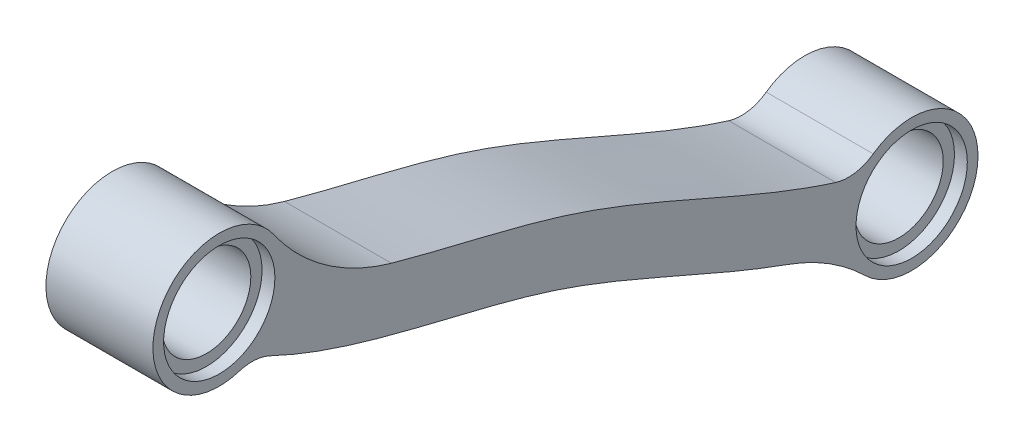
ISO-10303-21;
HEADER;
FILE_DESCRIPTION(('STEP AP214'),'2;1');
FILE_NAME('part.step','',(''),(''),'','','');
FILE_SCHEMA(('AUTOMOTIVE_DESIGN { 1 0 10303 214 1 1 1 1 }'));
ENDSEC;
DATA;
#1=APPLICATION_CONTEXT('core data for automotive mechanical design processes');
#2=APPLICATION_PROTOCOL_DEFINITION('international standard','automotive_design',2000,#1);
#3=PRODUCT_CONTEXT('',#1,'mechanical');
#4=PRODUCT('Part','Part','',(#3));
#5=PRODUCT_RELATED_PRODUCT_CATEGORY('part','',(#4));
#6=PRODUCT_DEFINITION_FORMATION('','',#4);
#7=PRODUCT_DEFINITION_CONTEXT('part definition',#1,'design');
#8=PRODUCT_DEFINITION('design','',#6,#7);
#9=PRODUCT_DEFINITION_SHAPE('','',#8);
#10=(LENGTH_UNIT() NAMED_UNIT(*) SI_UNIT(.MILLI.,.METRE.));
#11=(NAMED_UNIT(*) PLANE_ANGLE_UNIT() SI_UNIT($,.RADIAN.));
#12=(NAMED_UNIT(*) SI_UNIT($,.STERADIAN.) SOLID_ANGLE_UNIT());
#13=UNCERTAINTY_MEASURE_WITH_UNIT(LENGTH_MEASURE(1.E-05),#10,'distance_accuracy_value','');
#14=(GEOMETRIC_REPRESENTATION_CONTEXT(3) GLOBAL_UNCERTAINTY_ASSIGNED_CONTEXT((#13)) GLOBAL_UNIT_ASSIGNED_CONTEXT((#10,
#11,#12)) REPRESENTATION_CONTEXT('',''));
#15=CARTESIAN_POINT('',(0.,0.,0.));
#16=DIRECTION('',(0.,0.,1.));
#17=DIRECTION('',(1.,0.,0.));
#18=AXIS2_PLACEMENT_3D('',#15,#16,#17);
#19=CARTESIAN_POINT('',(2.5,-5.87,-17.805));
#20=DIRECTION('',(-1.,0.,0.));
#21=DIRECTION('',(0.,0.,1.));
#22=AXIS2_PLACEMENT_3D('',#19,#20,#21);
#23=CYLINDRICAL_SURFACE('',#22,2.075);
#24=CARTESIAN_POINT('',(1.9,-5.87,-17.805));
#25=DIRECTION('',(1.,0.,0.));
#26=DIRECTION('',(0.,0.,-1.));
#27=AXIS2_PLACEMENT_3D('',#24,#25,#26);
#28=CIRCLE('',#27,2.075);
#29=CARTESIAN_POINT('',(1.9,-5.87,-19.88));
#30=VERTEX_POINT('',#29);
#31=EDGE_CURVE('E166',#30,#30,#28,.T.);
#32=ORIENTED_EDGE('',*,*,#31,.T.);
#33=EDGE_LOOP('',(#32));
#34=FACE_BOUND('',#33,.T.);
#35=CARTESIAN_POINT('',(-1.9,-5.87,-17.805));
#36=DIRECTION('',(-1.,0.,0.));
#37=DIRECTION('',(0.,0.,1.));
#38=AXIS2_PLACEMENT_3D('',#35,#36,#37);
#39=CIRCLE('',#38,2.075);
#40=CARTESIAN_POINT('',(-1.9,-5.87,-15.73));
#41=VERTEX_POINT('',#40);
#42=EDGE_CURVE('E41',#41,#41,#39,.T.);
#43=ORIENTED_EDGE('',*,*,#42,.T.);
#44=EDGE_LOOP('',(#43));
#45=FACE_BOUND('',#44,.T.);
#46=ADVANCED_FACE('F37',(#34,#45),#23,.F.);
#47=CARTESIAN_POINT('',(2.5,5.62916512459887,14.555));
#48=DIRECTION('',(-1.,0.,0.));
#49=DIRECTION('',(0.,0.,1.));
#50=AXIS2_PLACEMENT_3D('',#47,#48,#49);
#51=CYLINDRICAL_SURFACE('',#50,2.075);
#52=CARTESIAN_POINT('',(1.9,5.62916512459887,14.555));
#53=DIRECTION('',(1.,0.,0.));
#54=DIRECTION('',(0.,0.,-1.));
#55=AXIS2_PLACEMENT_3D('',#52,#53,#54);
#56=CIRCLE('',#55,2.075);
#57=CARTESIAN_POINT('',(1.9,5.62916512459887,12.48));
#58=VERTEX_POINT('',#57);
#59=EDGE_CURVE('E163',#58,#58,#56,.T.);
#60=ORIENTED_EDGE('',*,*,#59,.T.);
#61=EDGE_LOOP('',(#60));
#62=FACE_BOUND('',#61,.T.);
#63=CARTESIAN_POINT('',(-1.9,5.62916512459887,14.555));
#64=DIRECTION('',(-1.,0.,0.));
#65=DIRECTION('',(0.,0.,1.));
#66=AXIS2_PLACEMENT_3D('',#63,#64,#65);
#67=CIRCLE('',#66,2.075);
#68=CARTESIAN_POINT('',(-1.9,5.62916512459887,16.63));
#69=VERTEX_POINT('',#68);
#70=EDGE_CURVE('E170',#69,#69,#67,.T.);
#71=ORIENTED_EDGE('',*,*,#70,.T.);
#72=EDGE_LOOP('',(#71));
#73=FACE_BOUND('',#72,.T.);
#74=ADVANCED_FACE('F214',(#62,#73),#51,.F.);
#75=CARTESIAN_POINT('',(2.5,6.74750579690508,13.7138869679471));
#76=CARTESIAN_POINT('',(2.5,5.14066339031288,11.5770379867886));
#77=CARTESIAN_POINT('',(2.5,3.7400831515323,7.84397075475957));
#78=CARTESIAN_POINT('',(2.5,2.42685512841546,2.26389990504039));
#79=CARTESIAN_POINT('',(2.5,1.30770586422285,-2.06634334978817));
#80=CARTESIAN_POINT('',(2.5,-0.350082751484617,-6.21182149975208));
#81=CARTESIAN_POINT('',(2.5,-2.11458102795827,-10.140310371826));
#82=CARTESIAN_POINT('',(2.5,-3.64692688049539,-14.0211160257836));
#83=CARTESIAN_POINT('',(2.5,-4.29840182557685,-16.6511461830664));
#84=CARTESIAN_POINT('',(2.5,-4.48307290035433,-17.995539810343));
#85=B_SPLINE_CURVE_WITH_KNOTS('',3,(#75,#76,#77,#78,#79,#80,#81,#82,#83,#84),.UNSPECIFIED.,.F.,
.F.,(4,1,1,1,1,1,1,4),(0.,0.25,0.375,0.5,0.625,0.75,0.875,1.),.UNSPECIFIED.);
#86=DIRECTION('',(-1.,0.,0.));
#87=VECTOR('',#86,1.);
#88=SURFACE_OF_LINEAR_EXTRUSION('',#85,#87);
#89=CARTESIAN_POINT('',(2.5,3.48931846089256,6.51083206647631));
#90=VERTEX_POINT('',#89);
#91=CARTESIAN_POINT('',(2.5,-3.62396617076279,-14.2516039961486));
#92=VERTEX_POINT('',#91);
#93=EDGE_CURVE('E128',#90,#92,#85,.T.);
#94=ORIENTED_EDGE('',*,*,#93,.T.);
#95=DIRECTION('',(-1.,0.,0.));
#96=VECTOR('',#95,1.);
#97=CARTESIAN_POINT('',(2.5,-3.62396617076279,-14.2516039961486));
#98=LINE('',#97,#96);
#99=CARTESIAN_POINT('',(-2.5,-3.62396617076279,-14.2516039961486));
#100=VERTEX_POINT('',#99);
#101=EDGE_CURVE('E150',#92,#100,#98,.T.);
#102=ORIENTED_EDGE('',*,*,#101,.T.);
#103=CARTESIAN_POINT('',(-2.5,6.74750579690508,13.7138869679471));
#104=CARTESIAN_POINT('',(-2.5,5.14066339031288,11.5770379867886));
#105=CARTESIAN_POINT('',(-2.5,3.7400831515323,7.84397075475957));
#106=CARTESIAN_POINT('',(-2.5,2.42685512841546,2.26389990504039));
#107=CARTESIAN_POINT('',(-2.5,1.30770586422285,-2.06634334978817));
#108=CARTESIAN_POINT('',(-2.5,-0.350082751484617,-6.21182149975208));
#109=CARTESIAN_POINT('',(-2.5,-2.11458102795827,-10.140310371826));
#110=CARTESIAN_POINT('',(-2.5,-3.64692688049539,-14.0211160257836));
#111=CARTESIAN_POINT('',(-2.5,-4.29840182557685,-16.6511461830664));
#112=CARTESIAN_POINT('',(-2.5,-4.48307290035433,-17.995539810343));
#113=B_SPLINE_CURVE_WITH_KNOTS('',3,(#103,#104,#105,#106,#107,#108,#109,#110,#111,#112),
.UNSPECIFIED.,.F.,.F.,(4,1,1,1,1,1,1,4),(0.,0.25,0.375,0.5,0.625,0.75,0.875,1.),.UNSPECIFIED.);
#114=CARTESIAN_POINT('',(-2.5,3.48931846089256,6.51083206647631));
#115=VERTEX_POINT('',#114);
#116=EDGE_CURVE('E169',#115,#100,#113,.T.);
#117=ORIENTED_EDGE('',*,*,#116,.F.);
#118=DIRECTION('',(-1.,0.,0.));
#119=VECTOR('',#118,1.);
#120=CARTESIAN_POINT('',(-2.5,3.48931846089256,6.51083206647631));
#121=LINE('',#120,#119);
#122=EDGE_CURVE('E114',#115,#90,#121,.F.);
#123=ORIENTED_EDGE('',*,*,#122,.T.);
#124=EDGE_LOOP('',(#94,#102,#117,#123));
#125=FACE_BOUND('',#124,.T.);
#126=ADVANCED_FACE('F209',(#125),#88,.T.);
#127=CARTESIAN_POINT('',(2.5,5.62916512459887,14.555));
#128=DIRECTION('',(-1.,0.,0.));
#129=DIRECTION('',(0.,0.,1.));
#130=AXIS2_PLACEMENT_3D('',#127,#128,#129);
#131=CYLINDRICAL_SURFACE('',#130,3.10000000000015);
#132=CARTESIAN_POINT('',(-2.5,5.62916512459887,14.555));
#133=DIRECTION('',(1.,0.,0.));
#134=DIRECTION('',(0.,0.,-1.));
#135=AXIS2_PLACEMENT_3D('',#132,#133,#134);
#136=CIRCLE('',#135,3.10000000000015);
#137=CARTESIAN_POINT('',(-2.5,7.40096253493936,12.0112362655483));
#138=VERTEX_POINT('',#137);
#139=CARTESIAN_POINT('',(-2.5,2.67177148345283,13.6255792926183));
#140=VERTEX_POINT('',#139);
#141=EDGE_CURVE('E134',#138,#140,#136,.T.);
#142=ORIENTED_EDGE('',*,*,#141,.T.);
#143=DIRECTION('',(-1.,0.,0.));
#144=VECTOR('',#143,1.);
#145=CARTESIAN_POINT('',(2.5,2.67177148345283,13.6255792926183));
#146=LINE('',#145,#144);
#147=CARTESIAN_POINT('',(2.5,2.67177148345283,13.6255792926183));
#148=VERTEX_POINT('',#147);
#149=EDGE_CURVE('E60',#140,#148,#146,.F.);
#150=ORIENTED_EDGE('',*,*,#149,.T.);
#151=CARTESIAN_POINT('',(2.5,5.62916512459887,14.555));
#152=DIRECTION('',(1.,0.,0.));
#153=DIRECTION('',(0.,0.,-1.));
#154=AXIS2_PLACEMENT_3D('',#151,#152,#153);
#155=CIRCLE('',#154,3.10000000000015);
#156=CARTESIAN_POINT('',(2.5,7.40096253493936,12.0112362655483));
#157=VERTEX_POINT('',#156);
#158=EDGE_CURVE('E132',#157,#148,#155,.T.);
#159=ORIENTED_EDGE('',*,*,#158,.F.);
#160=DIRECTION('',(-1.,0.,0.));
#161=VECTOR('',#160,1.);
#162=CARTESIAN_POINT('',(2.5,7.40096253493936,12.0112362655483));
#163=LINE('',#162,#161);
#164=EDGE_CURVE('E141',#157,#138,#163,.T.);
#165=ORIENTED_EDGE('',*,*,#164,.T.);
#166=EDGE_LOOP('',(#142,#150,#159,#165));
#167=FACE_BOUND('',#166,.T.);
#168=ADVANCED_FACE('F213',(#167),#131,.T.);
#169=CARTESIAN_POINT('',(2.5,4.51048584109107,15.3962909290085));
#170=CARTESIAN_POINT('',(2.5,4.03990521423956,14.7705213519791));
#171=CARTESIAN_POINT('',(2.5,3.1770019830119,13.4381774324881));
#172=CARTESIAN_POINT('',(2.5,1.84523827151937,10.704489555415));
#173=CARTESIAN_POINT('',(2.5,0.69941197848133,7.1508245954867));
#174=CARTESIAN_POINT('',(2.5,-0.304494056333449,2.87827779038143));
#175=CARTESIAN_POINT('',(2.5,-1.36079953781898,-1.19898875246983));
#176=CARTESIAN_POINT('',(2.5,-2.90772863047211,-5.0697971553987));
#177=CARTESIAN_POINT('',(2.5,-4.67885735726707,-9.01600603273946));
#178=CARTESIAN_POINT('',(2.5,-6.03636935138765,-12.442889207298));
#179=CARTESIAN_POINT('',(2.5,-6.85984413032387,-15.3298824626774));
#180=CARTESIAN_POINT('',(2.5,-7.15228586576536,-16.8534840446013));
#181=CARTESIAN_POINT('',(2.5,-7.25683712231477,-17.6144847501836));
#182=B_SPLINE_CURVE_WITH_KNOTS('',3,(#169,#170,#171,#172,#173,#174,#175,#176,#177,#178,#179,
#180,#181),.UNSPECIFIED.,.F.,.F.,(4,1,1,1,1,1,1,1,1,1,4),(0.,0.0625,0.125,0.25,0.375,0.5,0.625,
0.75,0.875,0.9375,1.),.UNSPECIFIED.);
#183=DIRECTION('',(-1.,0.,0.));
#184=VECTOR('',#183,1.);
#185=SURFACE_OF_LINEAR_EXTRUSION('',#182,#184);
#186=CARTESIAN_POINT('',(2.5,2.56919903689257,12.1654612153341));
#187=VERTEX_POINT('',#186);
#188=CARTESIAN_POINT('',(2.5,-5.8278136008078,-12.0213768108943));
#189=VERTEX_POINT('',#188);
#190=EDGE_CURVE('E247',#187,#189,#182,.T.);
#191=ORIENTED_EDGE('',*,*,#190,.F.);
#192=DIRECTION('',(-1.,0.,0.));
#193=VECTOR('',#192,1.);
#194=CARTESIAN_POINT('',(2.5,2.56919903689257,12.1654612153341));
#195=LINE('',#194,#193);
#196=CARTESIAN_POINT('',(-2.5,2.56919903689257,12.1654612153341));
#197=VERTEX_POINT('',#196);
#198=EDGE_CURVE('E155',#187,#197,#195,.T.);
#199=ORIENTED_EDGE('',*,*,#198,.T.);
#200=CARTESIAN_POINT('',(-2.5,4.51048584109107,15.3962909290085));
#201=CARTESIAN_POINT('',(-2.5,4.03990521423956,14.7705213519791));
#202=CARTESIAN_POINT('',(-2.5,3.1770019830119,13.4381774324881));
#203=CARTESIAN_POINT('',(-2.5,1.84523827151937,10.704489555415));
#204=CARTESIAN_POINT('',(-2.5,0.69941197848133,7.1508245954867));
#205=CARTESIAN_POINT('',(-2.5,-0.304494056333449,2.87827779038143));
#206=CARTESIAN_POINT('',(-2.5,-1.36079953781898,-1.19898875246983));
#207=CARTESIAN_POINT('',(-2.5,-2.90772863047211,-5.0697971553987));
#208=CARTESIAN_POINT('',(-2.5,-4.67885735726707,-9.01600603273946));
#209=CARTESIAN_POINT('',(-2.5,-6.03636935138765,-12.442889207298));
#210=CARTESIAN_POINT('',(-2.5,-6.85984413032387,-15.3298824626774));
#211=CARTESIAN_POINT('',(-2.5,-7.15228586576536,-16.8534840446013));
#212=CARTESIAN_POINT('',(-2.5,-7.25683712231477,-17.6144847501836));
#213=B_SPLINE_CURVE_WITH_KNOTS('',3,(#200,#201,#202,#203,#204,#205,#206,#207,#208,#209,#210,
#211,#212),.UNSPECIFIED.,.F.,.F.,(4,1,1,1,1,1,1,1,1,1,4),(0.,0.0625,0.125,0.25,0.375,0.5,0.625,
0.75,0.875,0.9375,1.),.UNSPECIFIED.);
#214=CARTESIAN_POINT('',(-2.5,-5.8278136008078,-12.0213768108943));
#215=VERTEX_POINT('',#214);
#216=EDGE_CURVE('E129',#197,#215,#213,.T.);
#217=ORIENTED_EDGE('',*,*,#216,.T.);
#218=DIRECTION('',(-1.,0.,0.));
#219=VECTOR('',#218,1.);
#220=CARTESIAN_POINT('',(-2.5,-5.8278136008078,-12.0213768108943));
#221=LINE('',#220,#219);
#222=EDGE_CURVE('E111',#215,#189,#221,.F.);
#223=ORIENTED_EDGE('',*,*,#222,.T.);
#224=EDGE_LOOP('',(#191,#199,#217,#223));
#225=FACE_BOUND('',#224,.T.);
#226=ADVANCED_FACE('F244',(#225),#185,.F.);
#227=CARTESIAN_POINT('',(2.5,-5.87,-17.805));
#228=DIRECTION('',(-1.,0.,0.));
#229=DIRECTION('',(0.,0.,1.));
#230=AXIS2_PLACEMENT_3D('',#227,#228,#229);
#231=CYLINDRICAL_SURFACE('',#230,3.1);
#232=CARTESIAN_POINT('',(-2.5,-5.87,-17.805));
#233=DIRECTION('',(1.,0.,0.));
#234=DIRECTION('',(0.,0.,-1.));
#235=AXIS2_PLACEMENT_3D('',#232,#233,#234);
#236=CIRCLE('',#235,3.1);
#237=CARTESIAN_POINT('',(-2.5,-8.08821912948754,-15.6394737605895));
#238=VERTEX_POINT('',#237);
#239=CARTESIAN_POINT('',(-2.5,-3.34434663297939,-16.0074808569427));
#240=VERTEX_POINT('',#239);
#241=EDGE_CURVE('E120',#238,#240,#236,.T.);
#242=ORIENTED_EDGE('',*,*,#241,.T.);
#243=DIRECTION('',(-1.,0.,0.));
#244=VECTOR('',#243,1.);
#245=CARTESIAN_POINT('',(2.5,-3.34434663297939,-16.0074808569427));
#246=LINE('',#245,#244);
#247=CARTESIAN_POINT('',(2.5,-3.34434663297939,-16.0074808569427));
#248=VERTEX_POINT('',#247);
#249=EDGE_CURVE('E153',#240,#248,#246,.F.);
#250=ORIENTED_EDGE('',*,*,#249,.T.);
#251=CARTESIAN_POINT('',(2.5,-5.87,-17.805));
#252=DIRECTION('',(1.,0.,0.));
#253=DIRECTION('',(0.,0.,-1.));
#254=AXIS2_PLACEMENT_3D('',#251,#252,#253);
#255=CIRCLE('',#254,3.1);
#256=CARTESIAN_POINT('',(2.5,-8.08821912948754,-15.6394737605895));
#257=VERTEX_POINT('',#256);
#258=EDGE_CURVE('E123',#257,#248,#255,.T.);
#259=ORIENTED_EDGE('',*,*,#258,.F.);
#260=DIRECTION('',(-1.,0.,0.));
#261=VECTOR('',#260,1.);
#262=CARTESIAN_POINT('',(2.5,-8.08821912948754,-15.6394737605895));
#263=LINE('',#262,#261);
#264=EDGE_CURVE('E109',#257,#238,#263,.T.);
#265=ORIENTED_EDGE('',*,*,#264,.T.);
#266=EDGE_LOOP('',(#242,#250,#259,#265));
#267=FACE_BOUND('',#266,.T.);
#268=ADVANCED_FACE('F119',(#267),#231,.T.);
#269=CARTESIAN_POINT('',(2.5,0.,0.));
#270=DIRECTION('',(1.,0.,0.));
#271=DIRECTION('',(0.,0.,-1.));
#272=AXIS2_PLACEMENT_3D('',#269,#270,#271);
#273=PLANE('',#272);
#274=CARTESIAN_POINT('',(2.5,5.62916512459887,14.555));
#275=DIRECTION('',(1.,0.,0.));
#276=DIRECTION('',(0.,0.,-1.));
#277=AXIS2_PLACEMENT_3D('',#274,#275,#276);
#278=CIRCLE('',#277,2.6);
#279=CARTESIAN_POINT('',(2.5,5.62916512459887,11.955));
#280=VERTEX_POINT('',#279);
#281=EDGE_CURVE('E193',#280,#280,#278,.T.);
#282=ORIENTED_EDGE('',*,*,#281,.F.);
#283=EDGE_LOOP('',(#282));
#284=FACE_BOUND('',#283,.T.);
#285=CARTESIAN_POINT('',(2.5,-5.87,-17.805));
#286=DIRECTION('',(1.,0.,0.));
#287=DIRECTION('',(0.,0.,-1.));
#288=AXIS2_PLACEMENT_3D('',#285,#286,#287);
#289=CIRCLE('',#288,2.6);
#290=CARTESIAN_POINT('',(2.5,-5.87,-20.405));
#291=VERTEX_POINT('',#290);
#292=EDGE_CURVE('E176',#291,#291,#289,.T.);
#293=ORIENTED_EDGE('',*,*,#292,.F.);
#294=EDGE_LOOP('',(#293));
#295=FACE_BOUND('',#294,.T.);
#296=ORIENTED_EDGE('',*,*,#93,.F.);
#297=CARTESIAN_POINT('',(2.5,13.1164380521664,3.80554679957548));
#298=DIRECTION('',(1.,0.,0.));
#299=DIRECTION('',(0.,0.,-1.));
#300=AXIS2_PLACEMENT_3D('',#297,#298,#299);
#301=CIRCLE('',#300,10.);
#302=EDGE_CURVE('E148',#90,#157,#301,.F.);
#303=ORIENTED_EDGE('',*,*,#302,.T.);
#304=ORIENTED_EDGE('',*,*,#158,.T.);
#305=CARTESIAN_POINT('',(2.5,0.763775585939346,13.0259530297915));
#306=DIRECTION('',(1.,0.,0.));
#307=DIRECTION('',(0.,0.,-1.));
#308=AXIS2_PLACEMENT_3D('',#305,#306,#307);
#309=CIRCLE('',#308,2.);
#310=EDGE_CURVE('E11',#148,#187,#309,.F.);
#311=ORIENTED_EDGE('',*,*,#310,.T.);
#312=ORIENTED_EDGE('',*,*,#190,.T.);
#313=CARTESIAN_POINT('',(2.5,-15.2437647084796,-8.65390524636193));
#314=DIRECTION('',(1.,0.,0.));
#315=DIRECTION('',(0.,0.,-1.));
#316=AXIS2_PLACEMENT_3D('',#313,#314,#315);
#317=CIRCLE('',#316,10.);
#318=EDGE_CURVE('E113',#189,#257,#317,.F.);
#319=ORIENTED_EDGE('',*,*,#318,.T.);
#320=ORIENTED_EDGE('',*,*,#258,.T.);
#321=CARTESIAN_POINT('',(2.5,-1.7148928478048,-14.8477910872283));
#322=DIRECTION('',(1.,0.,0.));
#323=DIRECTION('',(0.,0.,-1.));
#324=AXIS2_PLACEMENT_3D('',#321,#322,#323);
#325=CIRCLE('',#324,2.);
#326=EDGE_CURVE('E160',#248,#92,#325,.F.);
#327=ORIENTED_EDGE('',*,*,#326,.T.);
#328=EDGE_LOOP('',(#296,#303,#304,#311,#312,#319,#320,#327));
#329=FACE_BOUND('',#328,.T.);
#330=ADVANCED_FACE('F243',(#284,#295,#329),#273,.T.);
#331=CARTESIAN_POINT('',(-2.5,0.,0.));
#332=DIRECTION('',(1.,0.,0.));
#333=DIRECTION('',(0.,0.,-1.));
#334=AXIS2_PLACEMENT_3D('',#331,#332,#333);
#335=PLANE('',#334);
#336=CARTESIAN_POINT('',(-2.5,5.62916512459887,14.555));
#337=DIRECTION('',(-1.,0.,0.));
#338=DIRECTION('',(0.,0.,1.));
#339=AXIS2_PLACEMENT_3D('',#336,#337,#338);
#340=CIRCLE('',#339,2.6);
#341=CARTESIAN_POINT('',(-2.5,5.62916512459887,17.155));
#342=VERTEX_POINT('',#341);
#343=EDGE_CURVE('E178',#342,#342,#340,.T.);
#344=ORIENTED_EDGE('',*,*,#343,.F.);
#345=EDGE_LOOP('',(#344));
#346=FACE_BOUND('',#345,.T.);
#347=CARTESIAN_POINT('',(-2.5,-5.87,-17.805));
#348=DIRECTION('',(-1.,0.,0.));
#349=DIRECTION('',(0.,0.,1.));
#350=AXIS2_PLACEMENT_3D('',#347,#348,#349);
#351=CIRCLE('',#350,2.6);
#352=CARTESIAN_POINT('',(-2.5,-5.87,-15.205));
#353=VERTEX_POINT('',#352);
#354=EDGE_CURVE('E188',#353,#353,#351,.T.);
#355=ORIENTED_EDGE('',*,*,#354,.F.);
#356=EDGE_LOOP('',(#355));
#357=FACE_BOUND('',#356,.T.);
#358=ORIENTED_EDGE('',*,*,#141,.F.);
#359=CARTESIAN_POINT('',(-2.5,13.1164380521664,3.80554679957548));
#360=DIRECTION('',(1.,0.,0.));
#361=DIRECTION('',(0.,0.,-1.));
#362=AXIS2_PLACEMENT_3D('',#359,#360,#361);
#363=CIRCLE('',#362,10.);
#364=EDGE_CURVE('E146',#138,#115,#363,.T.);
#365=ORIENTED_EDGE('',*,*,#364,.T.);
#366=ORIENTED_EDGE('',*,*,#116,.T.);
#367=CARTESIAN_POINT('',(-2.5,-1.7148928478048,-14.8477910872283));
#368=DIRECTION('',(1.,0.,0.));
#369=DIRECTION('',(0.,0.,-1.));
#370=AXIS2_PLACEMENT_3D('',#367,#368,#369);
#371=CIRCLE('',#370,2.);
#372=EDGE_CURVE('E127',#100,#240,#371,.T.);
#373=ORIENTED_EDGE('',*,*,#372,.T.);
#374=ORIENTED_EDGE('',*,*,#241,.F.);
#375=CARTESIAN_POINT('',(-2.5,-15.2437647084796,-8.65390524636193));
#376=DIRECTION('',(1.,0.,0.));
#377=DIRECTION('',(0.,0.,-1.));
#378=AXIS2_PLACEMENT_3D('',#375,#376,#377);
#379=CIRCLE('',#378,10.);
#380=EDGE_CURVE('E105',#238,#215,#379,.T.);
#381=ORIENTED_EDGE('',*,*,#380,.T.);
#382=ORIENTED_EDGE('',*,*,#216,.F.);
#383=CARTESIAN_POINT('',(-2.5,0.763775585939346,13.0259530297915));
#384=DIRECTION('',(1.,0.,0.));
#385=DIRECTION('',(0.,0.,-1.));
#386=AXIS2_PLACEMENT_3D('',#383,#384,#385);
#387=CIRCLE('',#386,2.);
#388=EDGE_CURVE('E46',#197,#140,#387,.T.);
#389=ORIENTED_EDGE('',*,*,#388,.T.);
#390=EDGE_LOOP('',(#358,#365,#366,#373,#374,#381,#382,#389));
#391=FACE_BOUND('',#390,.T.);
#392=ADVANCED_FACE('F125',(#346,#357,#391),#335,.F.);
#393=CARTESIAN_POINT('',(0.,-15.2437647084796,-8.65390524636193));
#394=DIRECTION('',(-1.,0.,0.));
#395=DIRECTION('',(0.,0.,1.));
#396=AXIS2_PLACEMENT_3D('',#393,#394,#395);
#397=CYLINDRICAL_SURFACE('',#396,10.);
#398=ORIENTED_EDGE('',*,*,#318,.F.);
#399=ORIENTED_EDGE('',*,*,#222,.F.);
#400=ORIENTED_EDGE('',*,*,#380,.F.);
#401=ORIENTED_EDGE('',*,*,#264,.F.);
#402=EDGE_LOOP('',(#398,#399,#400,#401));
#403=FACE_BOUND('',#402,.T.);
#404=ADVANCED_FACE('F108',(#403),#397,.F.);
#405=CARTESIAN_POINT('',(0.,13.1164380521664,3.80554679957548));
#406=DIRECTION('',(-1.,0.,0.));
#407=DIRECTION('',(0.,0.,1.));
#408=AXIS2_PLACEMENT_3D('',#405,#406,#407);
#409=CYLINDRICAL_SURFACE('',#408,10.);
#410=ORIENTED_EDGE('',*,*,#302,.F.);
#411=ORIENTED_EDGE('',*,*,#122,.F.);
#412=ORIENTED_EDGE('',*,*,#364,.F.);
#413=ORIENTED_EDGE('',*,*,#164,.F.);
#414=EDGE_LOOP('',(#410,#411,#412,#413));
#415=FACE_BOUND('',#414,.T.);
#416=ADVANCED_FACE('F219',(#415),#409,.F.);
#417=CARTESIAN_POINT('',(0.,-1.7148928478048,-14.8477910872283));
#418=DIRECTION('',(-1.,0.,0.));
#419=DIRECTION('',(0.,0.,1.));
#420=AXIS2_PLACEMENT_3D('',#417,#418,#419);
#421=CYLINDRICAL_SURFACE('',#420,2.);
#422=ORIENTED_EDGE('',*,*,#326,.F.);
#423=ORIENTED_EDGE('',*,*,#249,.F.);
#424=ORIENTED_EDGE('',*,*,#372,.F.);
#425=ORIENTED_EDGE('',*,*,#101,.F.);
#426=EDGE_LOOP('',(#422,#423,#424,#425));
#427=FACE_BOUND('',#426,.T.);
#428=ADVANCED_FACE('F221',(#427),#421,.F.);
#429=CARTESIAN_POINT('',(0.,0.763775585939346,13.0259530297915));
#430=DIRECTION('',(-1.,0.,0.));
#431=DIRECTION('',(0.,0.,1.));
#432=AXIS2_PLACEMENT_3D('',#429,#430,#431);
#433=CYLINDRICAL_SURFACE('',#432,2.);
#434=ORIENTED_EDGE('',*,*,#310,.F.);
#435=ORIENTED_EDGE('',*,*,#149,.F.);
#436=ORIENTED_EDGE('',*,*,#388,.F.);
#437=ORIENTED_EDGE('',*,*,#198,.F.);
#438=EDGE_LOOP('',(#434,#435,#436,#437));
#439=FACE_BOUND('',#438,.T.);
#440=ADVANCED_FACE('F39',(#439),#433,.F.);
#441=CARTESIAN_POINT('',(1.9,-5.87,-17.805));
#442=DIRECTION('',(1.,0.,0.));
#443=DIRECTION('',(0.,0.,-1.));
#444=AXIS2_PLACEMENT_3D('',#441,#442,#443);
#445=CYLINDRICAL_SURFACE('',#444,2.6);
#446=CARTESIAN_POINT('',(1.9,-5.87,-17.805));
#447=DIRECTION('',(1.,0.,0.));
#448=DIRECTION('',(0.,0.,-1.));
#449=AXIS2_PLACEMENT_3D('',#446,#447,#448);
#450=CIRCLE('',#449,2.6);
#451=CARTESIAN_POINT('',(1.9,-5.87,-20.405));
#452=VERTEX_POINT('',#451);
#453=EDGE_CURVE('E196',#452,#452,#450,.T.);
#454=ORIENTED_EDGE('',*,*,#453,.F.);
#455=EDGE_LOOP('',(#454));
#456=FACE_BOUND('',#455,.T.);
#457=ORIENTED_EDGE('',*,*,#292,.T.);
#458=EDGE_LOOP('',(#457));
#459=FACE_BOUND('',#458,.T.);
#460=ADVANCED_FACE('F228',(#456,#459),#445,.F.);
#461=CARTESIAN_POINT('',(1.9,-5.87,-17.805));
#462=DIRECTION('',(1.,0.,0.));
#463=DIRECTION('',(0.,0.,-1.));
#464=AXIS2_PLACEMENT_3D('',#461,#462,#463);
#465=PLANE('',#464);
#466=ORIENTED_EDGE('',*,*,#31,.F.);
#467=EDGE_LOOP('',(#466));
#468=FACE_BOUND('',#467,.T.);
#469=ORIENTED_EDGE('',*,*,#453,.T.);
#470=EDGE_LOOP('',(#469));
#471=FACE_BOUND('',#470,.T.);
#472=ADVANCED_FACE('F283',(#468,#471),#465,.T.);
#473=CARTESIAN_POINT('',(1.9,5.62916512459887,14.555));
#474=DIRECTION('',(1.,0.,0.));
#475=DIRECTION('',(0.,0.,-1.));
#476=AXIS2_PLACEMENT_3D('',#473,#474,#475);
#477=CYLINDRICAL_SURFACE('',#476,2.6);
#478=CARTESIAN_POINT('',(1.9,5.62916512459887,14.555));
#479=DIRECTION('',(1.,0.,0.));
#480=DIRECTION('',(0.,0.,-1.));
#481=AXIS2_PLACEMENT_3D('',#478,#479,#480);
#482=CIRCLE('',#481,2.6);
#483=CARTESIAN_POINT('',(1.9,5.62916512459887,11.955));
#484=VERTEX_POINT('',#483);
#485=EDGE_CURVE('E167',#484,#484,#482,.T.);
#486=ORIENTED_EDGE('',*,*,#485,.F.);
#487=EDGE_LOOP('',(#486));
#488=FACE_BOUND('',#487,.T.);
#489=ORIENTED_EDGE('',*,*,#281,.T.);
#490=EDGE_LOOP('',(#489));
#491=FACE_BOUND('',#490,.T.);
#492=ADVANCED_FACE('F287',(#488,#491),#477,.F.);
#493=CARTESIAN_POINT('',(1.9,5.62916512459887,14.555));
#494=DIRECTION('',(1.,0.,0.));
#495=DIRECTION('',(0.,0.,-1.));
#496=AXIS2_PLACEMENT_3D('',#493,#494,#495);
#497=PLANE('',#496);
#498=ORIENTED_EDGE('',*,*,#59,.F.);
#499=EDGE_LOOP('',(#498));
#500=FACE_BOUND('',#499,.T.);
#501=ORIENTED_EDGE('',*,*,#485,.T.);
#502=EDGE_LOOP('',(#501));
#503=FACE_BOUND('',#502,.T.);
#504=ADVANCED_FACE('F291',(#500,#503),#497,.T.);
#505=CARTESIAN_POINT('',(-1.9,-5.87,-17.805));
#506=DIRECTION('',(-1.,0.,0.));
#507=DIRECTION('',(0.,0.,1.));
#508=AXIS2_PLACEMENT_3D('',#505,#506,#507);
#509=CYLINDRICAL_SURFACE('',#508,2.6);
#510=CARTESIAN_POINT('',(-1.9,-5.87,-17.805));
#511=DIRECTION('',(-1.,0.,0.));
#512=DIRECTION('',(0.,0.,1.));
#513=AXIS2_PLACEMENT_3D('',#510,#511,#512);
#514=CIRCLE('',#513,2.6);
#515=CARTESIAN_POINT('',(-1.9,-5.87,-15.205));
#516=VERTEX_POINT('',#515);
#517=EDGE_CURVE('E183',#516,#516,#514,.T.);
#518=ORIENTED_EDGE('',*,*,#517,.F.);
#519=EDGE_LOOP('',(#518));
#520=FACE_BOUND('',#519,.T.);
#521=ORIENTED_EDGE('',*,*,#354,.T.);
#522=EDGE_LOOP('',(#521));
#523=FACE_BOUND('',#522,.T.);
#524=ADVANCED_FACE('F295',(#520,#523),#509,.F.);
#525=CARTESIAN_POINT('',(-1.9,-5.87,-17.805));
#526=DIRECTION('',(-1.,0.,0.));
#527=DIRECTION('',(0.,0.,1.));
#528=AXIS2_PLACEMENT_3D('',#525,#526,#527);
#529=PLANE('',#528);
#530=ORIENTED_EDGE('',*,*,#42,.F.);
#531=EDGE_LOOP('',(#530));
#532=FACE_BOUND('',#531,.T.);
#533=ORIENTED_EDGE('',*,*,#517,.T.);
#534=EDGE_LOOP('',(#533));
#535=FACE_BOUND('',#534,.T.);
#536=ADVANCED_FACE('F299',(#532,#535),#529,.T.);
#537=CARTESIAN_POINT('',(-1.9,5.62916512459887,14.555));
#538=DIRECTION('',(-1.,0.,0.));
#539=DIRECTION('',(0.,0.,1.));
#540=AXIS2_PLACEMENT_3D('',#537,#538,#539);
#541=CYLINDRICAL_SURFACE('',#540,2.6);
#542=CARTESIAN_POINT('',(-1.9,5.62916512459887,14.555));
#543=DIRECTION('',(-1.,0.,0.));
#544=DIRECTION('',(0.,0.,1.));
#545=AXIS2_PLACEMENT_3D('',#542,#543,#544);
#546=CIRCLE('',#545,2.6);
#547=CARTESIAN_POINT('',(-1.9,5.62916512459887,17.155));
#548=VERTEX_POINT('',#547);
#549=EDGE_CURVE('E172',#548,#548,#546,.T.);
#550=ORIENTED_EDGE('',*,*,#549,.F.);
#551=EDGE_LOOP('',(#550));
#552=FACE_BOUND('',#551,.T.);
#553=ORIENTED_EDGE('',*,*,#343,.T.);
#554=EDGE_LOOP('',(#553));
#555=FACE_BOUND('',#554,.T.);
#556=ADVANCED_FACE('F303',(#552,#555),#541,.F.);
#557=CARTESIAN_POINT('',(-1.9,5.62916512459887,14.555));
#558=DIRECTION('',(-1.,0.,0.));
#559=DIRECTION('',(0.,0.,1.));
#560=AXIS2_PLACEMENT_3D('',#557,#558,#559);
#561=PLANE('',#560);
#562=ORIENTED_EDGE('',*,*,#70,.F.);
#563=EDGE_LOOP('',(#562));
#564=FACE_BOUND('',#563,.T.);
#565=ORIENTED_EDGE('',*,*,#549,.T.);
#566=EDGE_LOOP('',(#565));
#567=FACE_BOUND('',#566,.T.);
#568=ADVANCED_FACE('F307',(#564,#567),#561,.T.);
#569=CLOSED_SHELL('',(#46,#74,#126,#168,#226,#268,#330,#392,#404,#416,#428,#440,#460,#472,#492,
#504,#524,#536,#556,#568));
#570=MANIFOLD_SOLID_BREP('B2',#569);
#571=ADVANCED_BREP_SHAPE_REPRESENTATION('',(#18,#570),#14);
#572=SHAPE_DEFINITION_REPRESENTATION(#9,#571);
ENDSEC;
END-ISO-10303-21;
